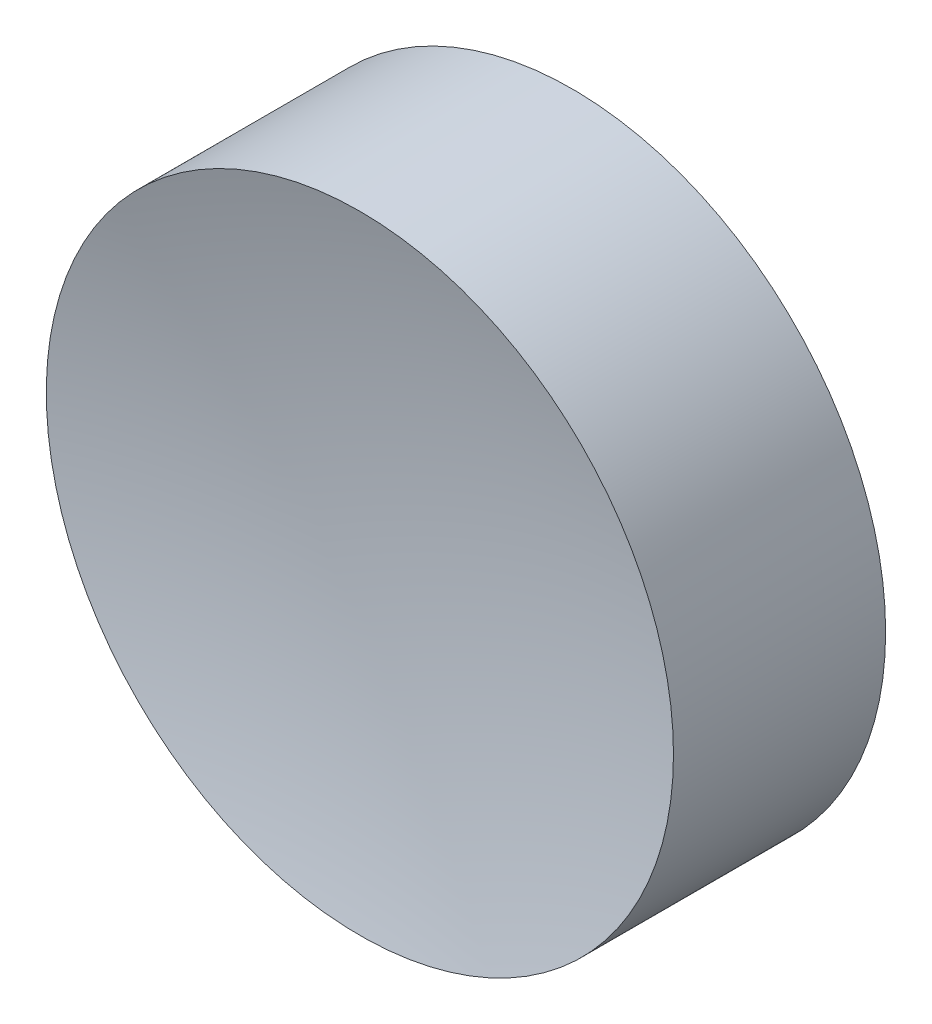
ISO-10303-21;
HEADER;
FILE_DESCRIPTION(('STEP AP214'),'2;1');
FILE_NAME('part.step','',(''),(''),'','','');
FILE_SCHEMA(('AUTOMOTIVE_DESIGN { 1 0 10303 214 1 1 1 1 }'));
ENDSEC;
DATA;
#1=APPLICATION_CONTEXT('core data for automotive mechanical design processes');
#2=APPLICATION_PROTOCOL_DEFINITION('international standard','automotive_design',2000,#1);
#3=PRODUCT_CONTEXT('',#1,'mechanical');
#4=PRODUCT('Part','Part','',(#3));
#5=PRODUCT_RELATED_PRODUCT_CATEGORY('part','',(#4));
#6=PRODUCT_DEFINITION_FORMATION('','',#4);
#7=PRODUCT_DEFINITION_CONTEXT('part definition',#1,'design');
#8=PRODUCT_DEFINITION('design','',#6,#7);
#9=PRODUCT_DEFINITION_SHAPE('','',#8);
#10=(LENGTH_UNIT() NAMED_UNIT(*) SI_UNIT(.MILLI.,.METRE.));
#11=(NAMED_UNIT(*) PLANE_ANGLE_UNIT() SI_UNIT($,.RADIAN.));
#12=(NAMED_UNIT(*) SI_UNIT($,.STERADIAN.) SOLID_ANGLE_UNIT());
#13=UNCERTAINTY_MEASURE_WITH_UNIT(LENGTH_MEASURE(1.E-05),#10,'distance_accuracy_value','');
#14=(GEOMETRIC_REPRESENTATION_CONTEXT(3) GLOBAL_UNCERTAINTY_ASSIGNED_CONTEXT((#13)) GLOBAL_UNIT_ASSIGNED_CONTEXT((#10,
#11,#12)) REPRESENTATION_CONTEXT('',''));
#15=CARTESIAN_POINT('',(0.,0.,0.));
#16=DIRECTION('',(0.,0.,1.));
#17=DIRECTION('',(1.,0.,0.));
#18=AXIS2_PLACEMENT_3D('',#15,#16,#17);
#19=CARTESIAN_POINT('',(0.,0.,27.0820605998367));
#20=DIRECTION('',(0.,0.,1.));
#21=DIRECTION('',(0.,1.,0.));
#22=AXIS2_PLACEMENT_3D('',#19,#20,#21);
#23=SPHERICAL_SURFACE('',#22,25.73);
#24=CARTESIAN_POINT('',(0.,0.,2.14793940016332));
#25=DIRECTION('',(0.,0.,1.));
#26=DIRECTION('',(1.,0.,0.));
#27=AXIS2_PLACEMENT_3D('',#24,#25,#26);
#28=CIRCLE('',#27,6.35);
#29=CARTESIAN_POINT('',(6.35,0.,2.14793940016332));
#30=VERTEX_POINT('',#29);
#31=EDGE_CURVE('E18',#30,#30,#28,.T.);
#32=ORIENTED_EDGE('',*,*,#31,.T.);
#33=EDGE_LOOP('',(#32));
#34=FACE_BOUND('',#33,.T.);
#35=ADVANCED_FACE('F12',(#34),#23,.F.);
#36=CARTESIAN_POINT('',(0.,0.,-2.14793940016333));
#37=DIRECTION('',(0.,0.,1.));
#38=DIRECTION('',(1.,0.,0.));
#39=AXIS2_PLACEMENT_3D('',#36,#37,#38);
#40=PLANE('',#39);
#41=CARTESIAN_POINT('',(0.,0.,-2.14793940016332));
#42=DIRECTION('',(0.,0.,1.));
#43=DIRECTION('',(1.,0.,0.));
#44=AXIS2_PLACEMENT_3D('',#41,#42,#43);
#45=CIRCLE('',#44,6.35);
#46=CARTESIAN_POINT('',(6.35,0.,-2.14793940016332));
#47=VERTEX_POINT('',#46);
#48=EDGE_CURVE('E8',#47,#47,#45,.T.);
#49=ORIENTED_EDGE('',*,*,#48,.F.);
#50=EDGE_LOOP('',(#49));
#51=FACE_BOUND('',#50,.T.);
#52=ADVANCED_FACE('F27',(#51),#40,.F.);
#53=CARTESIAN_POINT('',(0.,0.,8.619213870266));
#54=DIRECTION('',(0.,0.,1.));
#55=DIRECTION('',(1.,0.,0.));
#56=AXIS2_PLACEMENT_3D('',#53,#54,#55);
#57=CYLINDRICAL_SURFACE('',#56,6.35);
#58=ORIENTED_EDGE('',*,*,#31,.F.);
#59=EDGE_LOOP('',(#58));
#60=FACE_BOUND('',#59,.T.);
#61=ORIENTED_EDGE('',*,*,#48,.T.);
#62=EDGE_LOOP('',(#61));
#63=FACE_BOUND('',#62,.T.);
#64=ADVANCED_FACE('F25',(#60,#63),#57,.T.);
#65=CLOSED_SHELL('',(#35,#52,#64));
#66=MANIFOLD_SOLID_BREP('B1',#65);
#67=ADVANCED_BREP_SHAPE_REPRESENTATION('',(#18,#66),#14);
#68=SHAPE_DEFINITION_REPRESENTATION(#9,#67);
ENDSEC;
END-ISO-10303-21;
